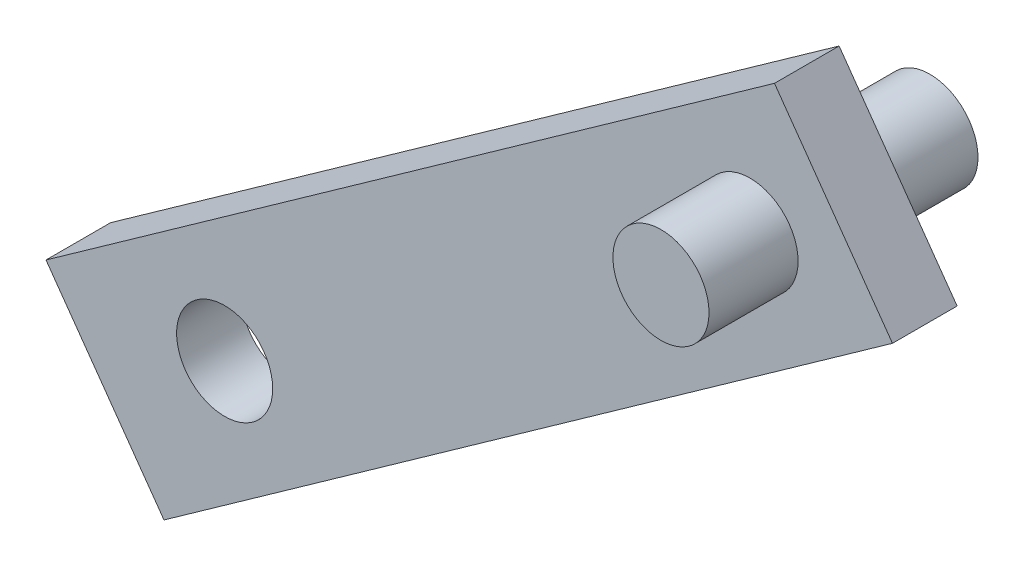
ISO-10303-21;
HEADER;
FILE_DESCRIPTION(('STEP AP214'),'2;1');
FILE_NAME('part.step','',(''),(''),'','','');
FILE_SCHEMA(('AUTOMOTIVE_DESIGN { 1 0 10303 214 1 1 1 1 }'));
ENDSEC;
DATA;
#1=APPLICATION_CONTEXT('core data for automotive mechanical design processes');
#2=APPLICATION_PROTOCOL_DEFINITION('international standard','automotive_design',2000,#1);
#3=PRODUCT_CONTEXT('',#1,'mechanical');
#4=PRODUCT('Part','Part','',(#3));
#5=PRODUCT_RELATED_PRODUCT_CATEGORY('part','',(#4));
#6=PRODUCT_DEFINITION_FORMATION('','',#4);
#7=PRODUCT_DEFINITION_CONTEXT('part definition',#1,'design');
#8=PRODUCT_DEFINITION('design','',#6,#7);
#9=PRODUCT_DEFINITION_SHAPE('','',#8);
#10=(LENGTH_UNIT() NAMED_UNIT(*) SI_UNIT(.MILLI.,.METRE.));
#11=(NAMED_UNIT(*) PLANE_ANGLE_UNIT() SI_UNIT($,.RADIAN.));
#12=(NAMED_UNIT(*) SI_UNIT($,.STERADIAN.) SOLID_ANGLE_UNIT());
#13=UNCERTAINTY_MEASURE_WITH_UNIT(LENGTH_MEASURE(1.E-05),#10,'distance_accuracy_value','');
#14=(GEOMETRIC_REPRESENTATION_CONTEXT(3) GLOBAL_UNCERTAINTY_ASSIGNED_CONTEXT((#13)) GLOBAL_UNIT_ASSIGNED_CONTEXT((#10,
#11,#12)) REPRESENTATION_CONTEXT('',''));
#15=CARTESIAN_POINT('',(0.,0.,0.));
#16=DIRECTION('',(0.,0.,1.));
#17=DIRECTION('',(1.,0.,0.));
#18=AXIS2_PLACEMENT_3D('',#15,#16,#17);
#19=CARTESIAN_POINT('',(-6.08609975503255,8.57197148596129,1.70891122027101));
#20=DIRECTION('',(-0.578921919080398,0.815382984620276,0.));
#21=DIRECTION('',(-0.815382984620276,-0.578921919080398,0.));
#22=AXIS2_PLACEMENT_3D('',#19,#20,#21);
#23=PLANE('',#22);
#24=DIRECTION('',(0.815382984620276,0.578921919080398,0.));
#25=VECTOR('',#24,1.);
#26=CARTESIAN_POINT('',(-6.08609975503255,8.57197148596129,0.));
#27=LINE('',#26,#25);
#28=CARTESIAN_POINT('',(-33.3109292629478,-10.7576574646586,0.));
#29=VERTEX_POINT('',#28);
#30=CARTESIAN_POINT('',(-14.0499524002476,2.91763610785858,0.));
#31=VERTEX_POINT('',#30);
#32=EDGE_CURVE('E106',#29,#31,#27,.T.);
#33=ORIENTED_EDGE('',*,*,#32,.T.);
#34=DIRECTION('',(0.,0.,-1.));
#35=VECTOR('',#34,1.);
#36=CARTESIAN_POINT('',(-14.0499524002476,2.91763610785858,1.70891122027101));
#37=LINE('',#36,#35);
#38=CARTESIAN_POINT('',(-14.0499524002476,2.91763610785858,1.70891122027101));
#39=VERTEX_POINT('',#38);
#40=EDGE_CURVE('E44',#39,#31,#37,.T.);
#41=ORIENTED_EDGE('',*,*,#40,.F.);
#42=DIRECTION('',(0.815382984620276,0.578921919080398,0.));
#43=VECTOR('',#42,1.);
#44=CARTESIAN_POINT('',(-6.08609975503255,8.57197148596129,1.70891122027101));
#45=LINE('',#44,#43);
#46=CARTESIAN_POINT('',(-33.3109292629478,-10.7576574646586,1.70891122027101));
#47=VERTEX_POINT('',#46);
#48=EDGE_CURVE('E86',#47,#39,#45,.T.);
#49=ORIENTED_EDGE('',*,*,#48,.F.);
#50=DIRECTION('',(0.,0.,-1.));
#51=VECTOR('',#50,1.);
#52=CARTESIAN_POINT('',(-33.3109292629478,-10.7576574646586,1.70891122027101));
#53=LINE('',#52,#51);
#54=EDGE_CURVE('E105',#47,#29,#53,.T.);
#55=ORIENTED_EDGE('',*,*,#54,.T.);
#56=EDGE_LOOP('',(#33,#41,#49,#55));
#57=FACE_BOUND('',#56,.T.);
#58=ADVANCED_FACE('F35',(#57),#23,.F.);
#59=CARTESIAN_POINT('',(-7.96385264521507,-5.65433537810271,1.70891122027101));
#60=DIRECTION('',(-0.815382984620276,-0.578921919080397,0.));
#61=DIRECTION('',(0.578921919080397,-0.815382984620276,0.));
#62=AXIS2_PLACEMENT_3D('',#59,#60,#61);
#63=PLANE('',#62);
#64=DIRECTION('',(-0.578921919080397,0.815382984620277,0.));
#65=VECTOR('',#64,1.);
#66=CARTESIAN_POINT('',(-7.96385264521507,-5.65433537810271,0.));
#67=LINE('',#66,#65);
#68=CARTESIAN_POINT('',(-17.1697186796501,7.3116731211015,0.));
#69=VERTEX_POINT('',#68);
#70=EDGE_CURVE('E92',#31,#69,#67,.T.);
#71=ORIENTED_EDGE('',*,*,#70,.T.);
#72=DIRECTION('',(0.,0.,-1.));
#73=VECTOR('',#72,1.);
#74=CARTESIAN_POINT('',(-17.1697186796501,7.3116731211015,1.70891122027101));
#75=LINE('',#74,#73);
#76=CARTESIAN_POINT('',(-17.1697186796501,7.3116731211015,1.70891122027101));
#77=VERTEX_POINT('',#76);
#78=EDGE_CURVE('E90',#77,#69,#75,.T.);
#79=ORIENTED_EDGE('',*,*,#78,.F.);
#80=DIRECTION('',(-0.578921919080397,0.815382984620277,0.));
#81=VECTOR('',#80,1.);
#82=CARTESIAN_POINT('',(-7.96385264521507,-5.65433537810271,1.70891122027101));
#83=LINE('',#82,#81);
#84=EDGE_CURVE('E80',#39,#77,#83,.T.);
#85=ORIENTED_EDGE('',*,*,#84,.F.);
#86=ORIENTED_EDGE('',*,*,#40,.T.);
#87=EDGE_LOOP('',(#71,#79,#85,#86));
#88=FACE_BOUND('',#87,.T.);
#89=ADVANCED_FACE('F91',(#88),#63,.F.);
#90=CARTESIAN_POINT('',(-9.20586603443499,12.9660084992042,1.70891122027101));
#91=DIRECTION('',(-0.578921919080397,0.815382984620277,0.));
#92=DIRECTION('',(-0.815382984620277,-0.578921919080397,0.));
#93=AXIS2_PLACEMENT_3D('',#90,#91,#92);
#94=PLANE('',#93);
#95=DIRECTION('',(0.815382984620277,0.578921919080397,0.));
#96=VECTOR('',#95,1.);
#97=CARTESIAN_POINT('',(-9.20586603443499,12.9660084992042,0.));
#98=LINE('',#97,#96);
#99=CARTESIAN_POINT('',(-36.4306955423503,-6.36362045141564,0.));
#100=VERTEX_POINT('',#99);
#101=EDGE_CURVE('E110',#100,#69,#98,.T.);
#102=ORIENTED_EDGE('',*,*,#101,.F.);
#103=DIRECTION('',(0.,0.,-1.));
#104=VECTOR('',#103,1.);
#105=CARTESIAN_POINT('',(-36.4306955423503,-6.36362045141564,1.70891122027101));
#106=LINE('',#105,#104);
#107=CARTESIAN_POINT('',(-36.4306955423503,-6.36362045141564,1.70891122027101));
#108=VERTEX_POINT('',#107);
#109=EDGE_CURVE('E69',#108,#100,#106,.T.);
#110=ORIENTED_EDGE('',*,*,#109,.F.);
#111=DIRECTION('',(0.815382984620277,0.578921919080397,0.));
#112=VECTOR('',#111,1.);
#113=CARTESIAN_POINT('',(-9.20586603443499,12.9660084992042,1.70891122027101));
#114=LINE('',#113,#112);
#115=EDGE_CURVE('E84',#108,#77,#114,.T.);
#116=ORIENTED_EDGE('',*,*,#115,.T.);
#117=ORIENTED_EDGE('',*,*,#78,.T.);
#118=EDGE_LOOP('',(#102,#110,#116,#117));
#119=FACE_BOUND('',#118,.T.);
#120=ADVANCED_FACE('F97',(#119),#94,.T.);
#121=CARTESIAN_POINT('',(-27.2248295079153,-19.3296289506198,1.70891122027101));
#122=DIRECTION('',(0.815382984620277,0.578921919080397,0.));
#123=DIRECTION('',(-0.578921919080397,0.815382984620277,0.));
#124=AXIS2_PLACEMENT_3D('',#121,#122,#123);
#125=PLANE('',#124);
#126=DIRECTION('',(0.578921919080397,-0.815382984620277,0.));
#127=VECTOR('',#126,1.);
#128=CARTESIAN_POINT('',(-27.2248295079153,-19.3296289506198,0.));
#129=LINE('',#128,#127);
#130=EDGE_CURVE('E72',#100,#29,#129,.T.);
#131=ORIENTED_EDGE('',*,*,#130,.T.);
#132=ORIENTED_EDGE('',*,*,#54,.F.);
#133=DIRECTION('',(0.578921919080397,-0.815382984620277,0.));
#134=VECTOR('',#133,1.);
#135=CARTESIAN_POINT('',(-27.2248295079153,-19.3296289506198,1.70891122027101));
#136=LINE('',#135,#134);
#137=EDGE_CURVE('E53',#108,#47,#136,.T.);
#138=ORIENTED_EDGE('',*,*,#137,.F.);
#139=ORIENTED_EDGE('',*,*,#109,.T.);
#140=EDGE_LOOP('',(#131,#132,#138,#139));
#141=FACE_BOUND('',#140,.T.);
#142=ADVANCED_FACE('F130',(#141),#125,.F.);
#143=CARTESIAN_POINT('',(-31.7072691846625,-6.31452327326669,1.70891122027101));
#144=DIRECTION('',(0.,0.,-1.));
#145=DIRECTION('',(-1.,0.,0.));
#146=AXIS2_PLACEMENT_3D('',#143,#144,#145);
#147=CYLINDRICAL_SURFACE('',#146,1.27);
#148=CARTESIAN_POINT('',(-31.7072691846625,-6.31452327326669,1.70891122027101));
#149=DIRECTION('',(0.,0.,1.));
#150=DIRECTION('',(1.,0.,0.));
#151=AXIS2_PLACEMENT_3D('',#148,#149,#150);
#152=CIRCLE('',#151,1.27);
#153=CARTESIAN_POINT('',(-30.4372691846625,-6.31452327326669,1.70891122027101));
#154=VERTEX_POINT('',#153);
#155=EDGE_CURVE('E99',#154,#154,#152,.T.);
#156=ORIENTED_EDGE('',*,*,#155,.T.);
#157=EDGE_LOOP('',(#156));
#158=FACE_BOUND('',#157,.T.);
#159=CARTESIAN_POINT('',(-31.7072691846625,-6.31452327326669,0.));
#160=DIRECTION('',(0.,0.,1.));
#161=DIRECTION('',(1.,0.,0.));
#162=AXIS2_PLACEMENT_3D('',#159,#160,#161);
#163=CIRCLE('',#162,1.27);
#164=CARTESIAN_POINT('',(-30.4372691846625,-6.31452327326669,0.));
#165=VERTEX_POINT('',#164);
#166=EDGE_CURVE('E113',#165,#165,#163,.T.);
#167=ORIENTED_EDGE('',*,*,#166,.F.);
#168=EDGE_LOOP('',(#167));
#169=FACE_BOUND('',#168,.T.);
#170=ADVANCED_FACE('F128',(#158,#169),#147,.F.);
#171=CARTESIAN_POINT('',(0.,0.,1.70891122027101));
#172=DIRECTION('',(0.,0.,1.));
#173=DIRECTION('',(1.,0.,0.));
#174=AXIS2_PLACEMENT_3D('',#171,#172,#173);
#175=PLANE('',#174);
#176=CARTESIAN_POINT('',(-17.8155280516451,3.54861293117565,1.70891122027101));
#177=DIRECTION('',(0.,0.,1.));
#178=DIRECTION('',(1.,0.,0.));
#179=AXIS2_PLACEMENT_3D('',#176,#177,#178);
#180=CIRCLE('',#179,1.27);
#181=CARTESIAN_POINT('',(-16.5455280516451,3.54861293117565,1.70891122027101));
#182=VERTEX_POINT('',#181);
#183=EDGE_CURVE('E11',#182,#182,#180,.T.);
#184=ORIENTED_EDGE('',*,*,#183,.F.);
#185=EDGE_LOOP('',(#184));
#186=FACE_BOUND('',#185,.T.);
#187=ORIENTED_EDGE('',*,*,#48,.T.);
#188=ORIENTED_EDGE('',*,*,#84,.T.);
#189=ORIENTED_EDGE('',*,*,#115,.F.);
#190=ORIENTED_EDGE('',*,*,#137,.T.);
#191=EDGE_LOOP('',(#187,#188,#189,#190));
#192=FACE_BOUND('',#191,.T.);
#193=ORIENTED_EDGE('',*,*,#155,.F.);
#194=EDGE_LOOP('',(#193));
#195=FACE_BOUND('',#194,.T.);
#196=ADVANCED_FACE('F81',(#186,#192,#195),#175,.T.);
#197=CARTESIAN_POINT('',(0.,0.,0.));
#198=DIRECTION('',(0.,0.,1.));
#199=DIRECTION('',(1.,0.,0.));
#200=AXIS2_PLACEMENT_3D('',#197,#198,#199);
#201=PLANE('',#200);
#202=CARTESIAN_POINT('',(-17.8155280516451,3.54861293117565,0.));
#203=DIRECTION('',(0.,0.,1.));
#204=DIRECTION('',(1.,0.,0.));
#205=AXIS2_PLACEMENT_3D('',#202,#203,#204);
#206=CIRCLE('',#205,1.27);
#207=CARTESIAN_POINT('',(-16.5455280516451,3.54861293117565,0.));
#208=VERTEX_POINT('',#207);
#209=EDGE_CURVE('E38',#208,#208,#206,.T.);
#210=ORIENTED_EDGE('',*,*,#209,.T.);
#211=EDGE_LOOP('',(#210));
#212=FACE_BOUND('',#211,.T.);
#213=ORIENTED_EDGE('',*,*,#32,.F.);
#214=ORIENTED_EDGE('',*,*,#130,.F.);
#215=ORIENTED_EDGE('',*,*,#101,.T.);
#216=ORIENTED_EDGE('',*,*,#70,.F.);
#217=EDGE_LOOP('',(#213,#214,#215,#216));
#218=FACE_BOUND('',#217,.T.);
#219=ORIENTED_EDGE('',*,*,#166,.T.);
#220=EDGE_LOOP('',(#219));
#221=FACE_BOUND('',#220,.T.);
#222=ADVANCED_FACE('F120',(#212,#218,#221),#201,.F.);
#223=CARTESIAN_POINT('',(0.,0.,-3.048));
#224=DIRECTION('',(0.,0.,1.));
#225=DIRECTION('',(1.,0.,0.));
#226=AXIS2_PLACEMENT_3D('',#223,#224,#225);
#227=PLANE('',#226);
#228=CARTESIAN_POINT('',(-17.8155280516451,3.54861293117565,-3.048));
#229=DIRECTION('',(0.,0.,1.));
#230=DIRECTION('',(1.,0.,0.));
#231=AXIS2_PLACEMENT_3D('',#228,#229,#230);
#232=CIRCLE('',#231,1.27);
#233=CARTESIAN_POINT('',(-16.5455280516451,3.54861293117565,-3.048));
#234=VERTEX_POINT('',#233);
#235=EDGE_CURVE('E231',#234,#234,#232,.T.);
#236=ORIENTED_EDGE('',*,*,#235,.F.);
#237=EDGE_LOOP('',(#236));
#238=FACE_BOUND('',#237,.T.);
#239=ADVANCED_FACE('F123',(#238),#227,.F.);
#240=CARTESIAN_POINT('',(-17.8155280516451,3.54861293117565,-3.048));
#241=DIRECTION('',(0.,0.,1.));
#242=DIRECTION('',(1.,0.,0.));
#243=AXIS2_PLACEMENT_3D('',#240,#241,#242);
#244=CYLINDRICAL_SURFACE('',#243,1.27);
#245=ORIENTED_EDGE('',*,*,#235,.T.);
#246=EDGE_LOOP('',(#245));
#247=FACE_BOUND('',#246,.T.);
#248=ORIENTED_EDGE('',*,*,#209,.F.);
#249=EDGE_LOOP('',(#248));
#250=FACE_BOUND('',#249,.T.);
#251=ADVANCED_FACE('F184',(#247,#250),#244,.T.);
#252=ORIENTED_EDGE('',*,*,#183,.T.);
#253=EDGE_LOOP('',(#252));
#254=FACE_BOUND('',#253,.T.);
#255=CARTESIAN_POINT('',(-17.8155280516451,3.54861293117565,4.064));
#256=DIRECTION('',(0.,0.,1.));
#257=DIRECTION('',(1.,0.,0.));
#258=AXIS2_PLACEMENT_3D('',#255,#256,#257);
#259=CIRCLE('',#258,1.27);
#260=CARTESIAN_POINT('',(-16.5455280516451,3.54861293117565,4.064));
#261=VERTEX_POINT('',#260);
#262=EDGE_CURVE('E229',#261,#261,#259,.T.);
#263=ORIENTED_EDGE('',*,*,#262,.F.);
#264=EDGE_LOOP('',(#263));
#265=FACE_BOUND('',#264,.T.);
#266=ADVANCED_FACE('F195',(#254,#265),#244,.T.);
#267=CARTESIAN_POINT('',(0.,0.,4.064));
#268=DIRECTION('',(0.,0.,1.));
#269=DIRECTION('',(1.,0.,0.));
#270=AXIS2_PLACEMENT_3D('',#267,#268,#269);
#271=PLANE('',#270);
#272=ORIENTED_EDGE('',*,*,#262,.T.);
#273=EDGE_LOOP('',(#272));
#274=FACE_BOUND('',#273,.T.);
#275=ADVANCED_FACE('F205',(#274),#271,.T.);
#276=CLOSED_SHELL('',(#58,#89,#120,#142,#170,#196,#222,#239,#251,#266,#275));
#277=MANIFOLD_SOLID_BREP('B2',#276);
#278=ADVANCED_BREP_SHAPE_REPRESENTATION('',(#18,#277),#14);
#279=SHAPE_DEFINITION_REPRESENTATION(#9,#278);
ENDSEC;
END-ISO-10303-21;
